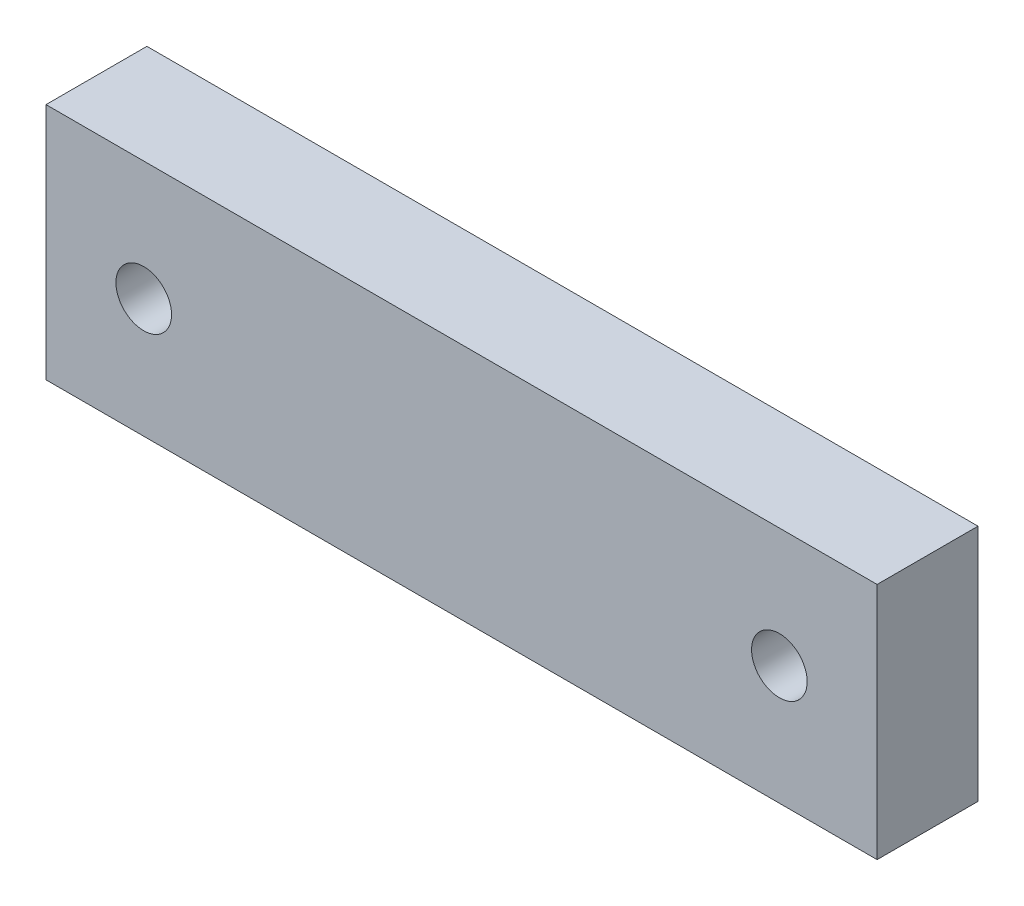
ISO-10303-21;
HEADER;
FILE_DESCRIPTION(('STEP AP214'),'2;1');
FILE_NAME('part.step','',(''),(''),'','','');
FILE_SCHEMA(('AUTOMOTIVE_DESIGN { 1 0 10303 214 1 1 1 1 }'));
ENDSEC;
DATA;
#1=APPLICATION_CONTEXT('core data for automotive mechanical design processes');
#2=APPLICATION_PROTOCOL_DEFINITION('international standard','automotive_design',2000,#1);
#3=PRODUCT_CONTEXT('',#1,'mechanical');
#4=PRODUCT('Part','Part','',(#3));
#5=PRODUCT_RELATED_PRODUCT_CATEGORY('part','',(#4));
#6=PRODUCT_DEFINITION_FORMATION('','',#4);
#7=PRODUCT_DEFINITION_CONTEXT('part definition',#1,'design');
#8=PRODUCT_DEFINITION('design','',#6,#7);
#9=PRODUCT_DEFINITION_SHAPE('','',#8);
#10=(LENGTH_UNIT() NAMED_UNIT(*) SI_UNIT(.MILLI.,.METRE.));
#11=(NAMED_UNIT(*) PLANE_ANGLE_UNIT() SI_UNIT($,.RADIAN.));
#12=(NAMED_UNIT(*) SI_UNIT($,.STERADIAN.) SOLID_ANGLE_UNIT());
#13=UNCERTAINTY_MEASURE_WITH_UNIT(LENGTH_MEASURE(1.E-05),#10,'distance_accuracy_value','');
#14=(GEOMETRIC_REPRESENTATION_CONTEXT(3) GLOBAL_UNCERTAINTY_ASSIGNED_CONTEXT((#13)) GLOBAL_UNIT_ASSIGNED_CONTEXT((#10,
#11,#12)) REPRESENTATION_CONTEXT('',''));
#15=CARTESIAN_POINT('',(0.,0.,0.));
#16=DIRECTION('',(0.,0.,1.));
#17=DIRECTION('',(1.,0.,0.));
#18=AXIS2_PLACEMENT_3D('',#15,#16,#17);
#19=CARTESIAN_POINT('',(0.,0.,6.35));
#20=DIRECTION('',(0.,0.,-1.));
#21=DIRECTION('',(-1.,0.,0.));
#22=AXIS2_PLACEMENT_3D('',#19,#20,#21);
#23=PLANE('',#22);
#24=DIRECTION('',(0.,-1.,0.));
#25=VECTOR('',#24,1.);
#26=CARTESIAN_POINT('',(0.,0.,6.35));
#27=LINE('',#26,#25);
#28=CARTESIAN_POINT('',(0.,15.,6.35));
#29=VERTEX_POINT('',#28);
#30=CARTESIAN_POINT('',(0.,0.,6.35));
#31=VERTEX_POINT('',#30);
#32=EDGE_CURVE('E93',#29,#31,#27,.T.);
#33=ORIENTED_EDGE('',*,*,#32,.T.);
#34=DIRECTION('',(1.,0.,0.));
#35=VECTOR('',#34,1.);
#36=CARTESIAN_POINT('',(0.,0.,6.35));
#37=LINE('',#36,#35);
#38=CARTESIAN_POINT('',(52.3,0.,6.35));
#39=VERTEX_POINT('',#38);
#40=EDGE_CURVE('E88',#31,#39,#37,.T.);
#41=ORIENTED_EDGE('',*,*,#40,.T.);
#42=DIRECTION('',(0.,1.,0.));
#43=VECTOR('',#42,1.);
#44=CARTESIAN_POINT('',(52.3,0.,6.35));
#45=LINE('',#44,#43);
#46=CARTESIAN_POINT('',(52.3,15.,6.35));
#47=VERTEX_POINT('',#46);
#48=EDGE_CURVE('E91',#39,#47,#45,.T.);
#49=ORIENTED_EDGE('',*,*,#48,.T.);
#50=DIRECTION('',(-1.,0.,0.));
#51=VECTOR('',#50,1.);
#52=CARTESIAN_POINT('',(0.,15.,6.35));
#53=LINE('',#52,#51);
#54=EDGE_CURVE('E58',#47,#29,#53,.T.);
#55=ORIENTED_EDGE('',*,*,#54,.T.);
#56=EDGE_LOOP('',(#33,#41,#49,#55));
#57=FACE_BOUND('',#56,.T.);
#58=CARTESIAN_POINT('',(6.15,7.5,6.35));
#59=DIRECTION('',(0.,0.,1.));
#60=DIRECTION('',(1.,0.,0.));
#61=AXIS2_PLACEMENT_3D('',#58,#59,#60);
#62=CIRCLE('',#61,1.75);
#63=CARTESIAN_POINT('',(7.9,7.5,6.35));
#64=VERTEX_POINT('',#63);
#65=EDGE_CURVE('E108',#64,#64,#62,.T.);
#66=ORIENTED_EDGE('',*,*,#65,.F.);
#67=EDGE_LOOP('',(#66));
#68=FACE_BOUND('',#67,.T.);
#69=CARTESIAN_POINT('',(46.15,7.5,6.35));
#70=DIRECTION('',(0.,0.,1.));
#71=DIRECTION('',(1.,0.,0.));
#72=AXIS2_PLACEMENT_3D('',#69,#70,#71);
#73=CIRCLE('',#72,1.75);
#74=CARTESIAN_POINT('',(47.9,7.5,6.35));
#75=VERTEX_POINT('',#74);
#76=EDGE_CURVE('E123',#75,#75,#73,.T.);
#77=ORIENTED_EDGE('',*,*,#76,.F.);
#78=EDGE_LOOP('',(#77));
#79=FACE_BOUND('',#78,.T.);
#80=ADVANCED_FACE('F41',(#57,#68,#79),#23,.F.);
#81=CARTESIAN_POINT('',(0.,0.,0.));
#82=DIRECTION('',(0.,0.,-1.));
#83=DIRECTION('',(-1.,0.,0.));
#84=AXIS2_PLACEMENT_3D('',#81,#82,#83);
#85=PLANE('',#84);
#86=CARTESIAN_POINT('',(6.15,7.5,0.));
#87=DIRECTION('',(0.,0.,1.));
#88=DIRECTION('',(1.,0.,0.));
#89=AXIS2_PLACEMENT_3D('',#86,#87,#88);
#90=CIRCLE('',#89,1.75);
#91=CARTESIAN_POINT('',(7.9,7.5,0.));
#92=VERTEX_POINT('',#91);
#93=EDGE_CURVE('E120',#92,#92,#90,.T.);
#94=ORIENTED_EDGE('',*,*,#93,.T.);
#95=EDGE_LOOP('',(#94));
#96=FACE_BOUND('',#95,.T.);
#97=DIRECTION('',(0.,-1.,0.));
#98=VECTOR('',#97,1.);
#99=CARTESIAN_POINT('',(0.,0.,0.));
#100=LINE('',#99,#98);
#101=CARTESIAN_POINT('',(0.,15.,0.));
#102=VERTEX_POINT('',#101);
#103=CARTESIAN_POINT('',(0.,0.,0.));
#104=VERTEX_POINT('',#103);
#105=EDGE_CURVE('E105',#102,#104,#100,.T.);
#106=ORIENTED_EDGE('',*,*,#105,.F.);
#107=DIRECTION('',(-1.,0.,0.));
#108=VECTOR('',#107,1.);
#109=CARTESIAN_POINT('',(0.,15.,0.));
#110=LINE('',#109,#108);
#111=CARTESIAN_POINT('',(52.3,15.,0.));
#112=VERTEX_POINT('',#111);
#113=EDGE_CURVE('E81',#112,#102,#110,.T.);
#114=ORIENTED_EDGE('',*,*,#113,.F.);
#115=DIRECTION('',(0.,1.,0.));
#116=VECTOR('',#115,1.);
#117=CARTESIAN_POINT('',(52.3,0.,0.));
#118=LINE('',#117,#116);
#119=CARTESIAN_POINT('',(52.3,0.,0.));
#120=VERTEX_POINT('',#119);
#121=EDGE_CURVE('E75',#120,#112,#118,.T.);
#122=ORIENTED_EDGE('',*,*,#121,.F.);
#123=DIRECTION('',(1.,0.,0.));
#124=VECTOR('',#123,1.);
#125=CARTESIAN_POINT('',(0.,0.,0.));
#126=LINE('',#125,#124);
#127=EDGE_CURVE('E97',#104,#120,#126,.T.);
#128=ORIENTED_EDGE('',*,*,#127,.F.);
#129=EDGE_LOOP('',(#106,#114,#122,#128));
#130=FACE_BOUND('',#129,.T.);
#131=CARTESIAN_POINT('',(46.15,7.5,0.));
#132=DIRECTION('',(0.,0.,1.));
#133=DIRECTION('',(1.,0.,0.));
#134=AXIS2_PLACEMENT_3D('',#131,#132,#133);
#135=CIRCLE('',#134,1.75);
#136=CARTESIAN_POINT('',(47.9,7.5,0.));
#137=VERTEX_POINT('',#136);
#138=EDGE_CURVE('E126',#137,#137,#135,.T.);
#139=ORIENTED_EDGE('',*,*,#138,.T.);
#140=EDGE_LOOP('',(#139));
#141=FACE_BOUND('',#140,.T.);
#142=ADVANCED_FACE('F116',(#96,#130,#141),#85,.T.);
#143=CARTESIAN_POINT('',(0.,0.,6.35));
#144=DIRECTION('',(1.,0.,0.));
#145=DIRECTION('',(0.,0.,-1.));
#146=AXIS2_PLACEMENT_3D('',#143,#144,#145);
#147=PLANE('',#146);
#148=ORIENTED_EDGE('',*,*,#105,.T.);
#149=DIRECTION('',(0.,0.,-1.));
#150=VECTOR('',#149,1.);
#151=CARTESIAN_POINT('',(0.,0.,6.35));
#152=LINE('',#151,#150);
#153=EDGE_CURVE('E11',#31,#104,#152,.T.);
#154=ORIENTED_EDGE('',*,*,#153,.F.);
#155=ORIENTED_EDGE('',*,*,#32,.F.);
#156=DIRECTION('',(0.,0.,-1.));
#157=VECTOR('',#156,1.);
#158=CARTESIAN_POINT('',(0.,15.,6.35));
#159=LINE('',#158,#157);
#160=EDGE_CURVE('E101',#29,#102,#159,.T.);
#161=ORIENTED_EDGE('',*,*,#160,.T.);
#162=EDGE_LOOP('',(#148,#154,#155,#161));
#163=FACE_BOUND('',#162,.T.);
#164=ADVANCED_FACE('F43',(#163),#147,.F.);
#165=CARTESIAN_POINT('',(0.,0.,6.35));
#166=DIRECTION('',(0.,1.,0.));
#167=DIRECTION('',(0.,0.,1.));
#168=AXIS2_PLACEMENT_3D('',#165,#166,#167);
#169=PLANE('',#168);
#170=ORIENTED_EDGE('',*,*,#127,.T.);
#171=DIRECTION('',(0.,0.,-1.));
#172=VECTOR('',#171,1.);
#173=CARTESIAN_POINT('',(52.3,0.,6.35));
#174=LINE('',#173,#172);
#175=EDGE_CURVE('E50',#39,#120,#174,.T.);
#176=ORIENTED_EDGE('',*,*,#175,.F.);
#177=ORIENTED_EDGE('',*,*,#40,.F.);
#178=ORIENTED_EDGE('',*,*,#153,.T.);
#179=EDGE_LOOP('',(#170,#176,#177,#178));
#180=FACE_BOUND('',#179,.T.);
#181=ADVANCED_FACE('F96',(#180),#169,.F.);
#182=CARTESIAN_POINT('',(52.3,0.,6.35));
#183=DIRECTION('',(-1.,0.,0.));
#184=DIRECTION('',(0.,0.,1.));
#185=AXIS2_PLACEMENT_3D('',#182,#183,#184);
#186=PLANE('',#185);
#187=ORIENTED_EDGE('',*,*,#121,.T.);
#188=DIRECTION('',(0.,0.,-1.));
#189=VECTOR('',#188,1.);
#190=CARTESIAN_POINT('',(52.3,15.,6.35));
#191=LINE('',#190,#189);
#192=EDGE_CURVE('E98',#47,#112,#191,.T.);
#193=ORIENTED_EDGE('',*,*,#192,.F.);
#194=ORIENTED_EDGE('',*,*,#48,.F.);
#195=ORIENTED_EDGE('',*,*,#175,.T.);
#196=EDGE_LOOP('',(#187,#193,#194,#195));
#197=FACE_BOUND('',#196,.T.);
#198=ADVANCED_FACE('F99',(#197),#186,.F.);
#199=CARTESIAN_POINT('',(0.,15.,6.35));
#200=DIRECTION('',(0.,-1.,0.));
#201=DIRECTION('',(0.,0.,-1.));
#202=AXIS2_PLACEMENT_3D('',#199,#200,#201);
#203=PLANE('',#202);
#204=ORIENTED_EDGE('',*,*,#113,.T.);
#205=ORIENTED_EDGE('',*,*,#160,.F.);
#206=ORIENTED_EDGE('',*,*,#54,.F.);
#207=ORIENTED_EDGE('',*,*,#192,.T.);
#208=EDGE_LOOP('',(#204,#205,#206,#207));
#209=FACE_BOUND('',#208,.T.);
#210=ADVANCED_FACE('F113',(#209),#203,.F.);
#211=CARTESIAN_POINT('',(6.15,7.5,6.35));
#212=DIRECTION('',(0.,0.,-1.));
#213=DIRECTION('',(-1.,0.,0.));
#214=AXIS2_PLACEMENT_3D('',#211,#212,#213);
#215=CYLINDRICAL_SURFACE('',#214,1.75);
#216=ORIENTED_EDGE('',*,*,#65,.T.);
#217=EDGE_LOOP('',(#216));
#218=FACE_BOUND('',#217,.T.);
#219=ORIENTED_EDGE('',*,*,#93,.F.);
#220=EDGE_LOOP('',(#219));
#221=FACE_BOUND('',#220,.T.);
#222=ADVANCED_FACE('F143',(#218,#221),#215,.F.);
#223=CARTESIAN_POINT('',(46.15,7.5,6.35));
#224=DIRECTION('',(0.,0.,-1.));
#225=DIRECTION('',(-1.,0.,0.));
#226=AXIS2_PLACEMENT_3D('',#223,#224,#225);
#227=CYLINDRICAL_SURFACE('',#226,1.75);
#228=ORIENTED_EDGE('',*,*,#76,.T.);
#229=EDGE_LOOP('',(#228));
#230=FACE_BOUND('',#229,.T.);
#231=ORIENTED_EDGE('',*,*,#138,.F.);
#232=EDGE_LOOP('',(#231));
#233=FACE_BOUND('',#232,.T.);
#234=ADVANCED_FACE('F132',(#230,#233),#227,.F.);
#235=CLOSED_SHELL('',(#80,#142,#164,#181,#198,#210,#222,#234));
#236=MANIFOLD_SOLID_BREP('B2',#235);
#237=ADVANCED_BREP_SHAPE_REPRESENTATION('',(#18,#236),#14);
#238=SHAPE_DEFINITION_REPRESENTATION(#9,#237);
ENDSEC;
END-ISO-10303-21;
